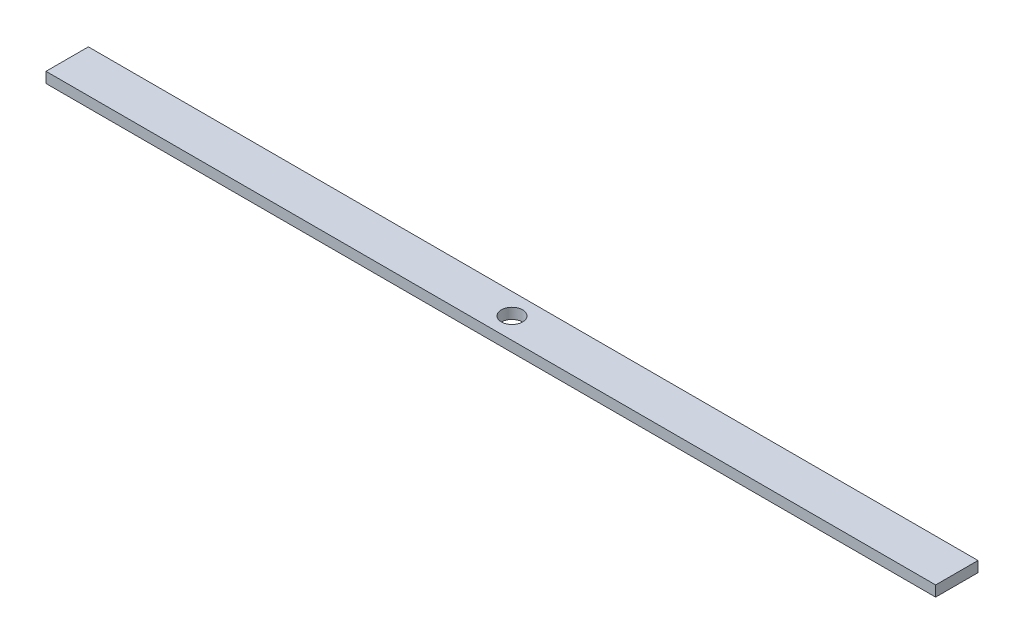
ISO-10303-21;
HEADER;
FILE_DESCRIPTION(('STEP AP214'),'2;1');
FILE_NAME('part.step','',(''),(''),'','','');
FILE_SCHEMA(('AUTOMOTIVE_DESIGN { 1 0 10303 214 1 1 1 1 }'));
ENDSEC;
DATA;
#1=APPLICATION_CONTEXT('core data for automotive mechanical design processes');
#2=APPLICATION_PROTOCOL_DEFINITION('international standard','automotive_design',2000,#1);
#3=PRODUCT_CONTEXT('',#1,'mechanical');
#4=PRODUCT('Part','Part','',(#3));
#5=PRODUCT_RELATED_PRODUCT_CATEGORY('part','',(#4));
#6=PRODUCT_DEFINITION_FORMATION('','',#4);
#7=PRODUCT_DEFINITION_CONTEXT('part definition',#1,'design');
#8=PRODUCT_DEFINITION('design','',#6,#7);
#9=PRODUCT_DEFINITION_SHAPE('','',#8);
#10=(LENGTH_UNIT() NAMED_UNIT(*) SI_UNIT(.MILLI.,.METRE.));
#11=(NAMED_UNIT(*) PLANE_ANGLE_UNIT() SI_UNIT($,.RADIAN.));
#12=(NAMED_UNIT(*) SI_UNIT($,.STERADIAN.) SOLID_ANGLE_UNIT());
#13=UNCERTAINTY_MEASURE_WITH_UNIT(LENGTH_MEASURE(1.E-05),#10,'distance_accuracy_value','');
#14=(GEOMETRIC_REPRESENTATION_CONTEXT(3) GLOBAL_UNCERTAINTY_ASSIGNED_CONTEXT((#13)) GLOBAL_UNIT_ASSIGNED_CONTEXT((#10,
#11,#12)) REPRESENTATION_CONTEXT('',''));
#15=CARTESIAN_POINT('',(0.,0.,0.));
#16=DIRECTION('',(0.,0.,1.));
#17=DIRECTION('',(1.,0.,0.));
#18=AXIS2_PLACEMENT_3D('',#15,#16,#17);
#19=CARTESIAN_POINT('',(0.,6.35,0.));
#20=DIRECTION('',(0.,1.,0.));
#21=DIRECTION('',(0.,0.,1.));
#22=AXIS2_PLACEMENT_3D('',#19,#20,#21);
#23=PLANE('',#22);
#24=DIRECTION('',(0.,0.,-1.));
#25=VECTOR('',#24,1.);
#26=CARTESIAN_POINT('',(266.7,6.35,-12.7));
#27=LINE('',#26,#25);
#28=CARTESIAN_POINT('',(266.7,6.35,12.7));
#29=VERTEX_POINT('',#28);
#30=CARTESIAN_POINT('',(266.7,6.35,-12.7));
#31=VERTEX_POINT('',#30);
#32=EDGE_CURVE('E92',#29,#31,#27,.T.);
#33=ORIENTED_EDGE('',*,*,#32,.T.);
#34=DIRECTION('',(-1.,0.,0.));
#35=VECTOR('',#34,1.);
#36=CARTESIAN_POINT('',(-266.7,6.35,-12.7));
#37=LINE('',#36,#35);
#38=CARTESIAN_POINT('',(-266.7,6.35,-12.7));
#39=VERTEX_POINT('',#38);
#40=EDGE_CURVE('E87',#31,#39,#37,.T.);
#41=ORIENTED_EDGE('',*,*,#40,.T.);
#42=DIRECTION('',(0.,0.,1.));
#43=VECTOR('',#42,1.);
#44=CARTESIAN_POINT('',(-266.7,6.35,-12.7));
#45=LINE('',#44,#43);
#46=CARTESIAN_POINT('',(-266.7,6.35,12.7));
#47=VERTEX_POINT('',#46);
#48=EDGE_CURVE('E90',#39,#47,#45,.T.);
#49=ORIENTED_EDGE('',*,*,#48,.T.);
#50=DIRECTION('',(1.,0.,0.));
#51=VECTOR('',#50,1.);
#52=CARTESIAN_POINT('',(-266.7,6.35,12.7));
#53=LINE('',#52,#51);
#54=EDGE_CURVE('E57',#47,#29,#53,.T.);
#55=ORIENTED_EDGE('',*,*,#54,.T.);
#56=EDGE_LOOP('',(#33,#41,#49,#55));
#57=FACE_BOUND('',#56,.T.);
#58=CARTESIAN_POINT('',(0.,6.35,0.));
#59=DIRECTION('',(0.,1.,0.));
#60=DIRECTION('',(0.,0.,1.));
#61=AXIS2_PLACEMENT_3D('',#58,#59,#60);
#62=CIRCLE('',#61,6.35);
#63=CARTESIAN_POINT('',(0.,6.35,6.35));
#64=VERTEX_POINT('',#63);
#65=EDGE_CURVE('E112',#64,#64,#62,.T.);
#66=ORIENTED_EDGE('',*,*,#65,.F.);
#67=EDGE_LOOP('',(#66));
#68=FACE_BOUND('',#67,.T.);
#69=ADVANCED_FACE('F39',(#57,#68),#23,.T.);
#70=CARTESIAN_POINT('',(0.,0.,0.));
#71=DIRECTION('',(0.,1.,0.));
#72=DIRECTION('',(0.,0.,1.));
#73=AXIS2_PLACEMENT_3D('',#70,#71,#72);
#74=PLANE('',#73);
#75=DIRECTION('',(0.,0.,-1.));
#76=VECTOR('',#75,1.);
#77=CARTESIAN_POINT('',(266.7,0.,-12.7));
#78=LINE('',#77,#76);
#79=CARTESIAN_POINT('',(266.7,0.,12.7));
#80=VERTEX_POINT('',#79);
#81=CARTESIAN_POINT('',(266.7,0.,-12.7));
#82=VERTEX_POINT('',#81);
#83=EDGE_CURVE('E108',#80,#82,#78,.T.);
#84=ORIENTED_EDGE('',*,*,#83,.F.);
#85=DIRECTION('',(1.,0.,0.));
#86=VECTOR('',#85,1.);
#87=CARTESIAN_POINT('',(-266.7,0.,12.7));
#88=LINE('',#87,#86);
#89=CARTESIAN_POINT('',(-266.7,0.,12.7));
#90=VERTEX_POINT('',#89);
#91=EDGE_CURVE('E80',#90,#80,#88,.T.);
#92=ORIENTED_EDGE('',*,*,#91,.F.);
#93=DIRECTION('',(0.,0.,1.));
#94=VECTOR('',#93,1.);
#95=CARTESIAN_POINT('',(-266.7,0.,-12.7));
#96=LINE('',#95,#94);
#97=CARTESIAN_POINT('',(-266.7,0.,-12.7));
#98=VERTEX_POINT('',#97);
#99=EDGE_CURVE('E74',#98,#90,#96,.T.);
#100=ORIENTED_EDGE('',*,*,#99,.F.);
#101=DIRECTION('',(-1.,0.,0.));
#102=VECTOR('',#101,1.);
#103=CARTESIAN_POINT('',(-266.7,0.,-12.7));
#104=LINE('',#103,#102);
#105=EDGE_CURVE('E97',#82,#98,#104,.T.);
#106=ORIENTED_EDGE('',*,*,#105,.F.);
#107=EDGE_LOOP('',(#84,#92,#100,#106));
#108=FACE_BOUND('',#107,.T.);
#109=CARTESIAN_POINT('',(0.,0.,0.));
#110=DIRECTION('',(0.,1.,0.));
#111=DIRECTION('',(0.,0.,1.));
#112=AXIS2_PLACEMENT_3D('',#109,#110,#111);
#113=CIRCLE('',#112,6.35);
#114=CARTESIAN_POINT('',(0.,0.,6.35));
#115=VERTEX_POINT('',#114);
#116=EDGE_CURVE('E130',#115,#115,#113,.T.);
#117=ORIENTED_EDGE('',*,*,#116,.T.);
#118=EDGE_LOOP('',(#117));
#119=FACE_BOUND('',#118,.T.);
#120=ADVANCED_FACE('F125',(#108,#119),#74,.F.);
#121=CARTESIAN_POINT('',(266.7,6.35,-12.7));
#122=DIRECTION('',(-1.,0.,0.));
#123=DIRECTION('',(0.,0.,1.));
#124=AXIS2_PLACEMENT_3D('',#121,#122,#123);
#125=PLANE('',#124);
#126=ORIENTED_EDGE('',*,*,#83,.T.);
#127=DIRECTION('',(0.,-1.,0.));
#128=VECTOR('',#127,1.);
#129=CARTESIAN_POINT('',(266.7,6.35,-12.7));
#130=LINE('',#129,#128);
#131=EDGE_CURVE('E11',#31,#82,#130,.T.);
#132=ORIENTED_EDGE('',*,*,#131,.F.);
#133=ORIENTED_EDGE('',*,*,#32,.F.);
#134=DIRECTION('',(0.,-1.,0.));
#135=VECTOR('',#134,1.);
#136=CARTESIAN_POINT('',(266.7,6.35,12.7));
#137=LINE('',#136,#135);
#138=EDGE_CURVE('E104',#29,#80,#137,.T.);
#139=ORIENTED_EDGE('',*,*,#138,.T.);
#140=EDGE_LOOP('',(#126,#132,#133,#139));
#141=FACE_BOUND('',#140,.T.);
#142=ADVANCED_FACE('F41',(#141),#125,.F.);
#143=CARTESIAN_POINT('',(-266.7,6.35,-12.7));
#144=DIRECTION('',(0.,0.,1.));
#145=DIRECTION('',(1.,0.,0.));
#146=AXIS2_PLACEMENT_3D('',#143,#144,#145);
#147=PLANE('',#146);
#148=ORIENTED_EDGE('',*,*,#105,.T.);
#149=DIRECTION('',(0.,-1.,0.));
#150=VECTOR('',#149,1.);
#151=CARTESIAN_POINT('',(-266.7,6.35,-12.7));
#152=LINE('',#151,#150);
#153=EDGE_CURVE('E49',#39,#98,#152,.T.);
#154=ORIENTED_EDGE('',*,*,#153,.F.);
#155=ORIENTED_EDGE('',*,*,#40,.F.);
#156=ORIENTED_EDGE('',*,*,#131,.T.);
#157=EDGE_LOOP('',(#148,#154,#155,#156));
#158=FACE_BOUND('',#157,.T.);
#159=ADVANCED_FACE('F96',(#158),#147,.F.);
#160=CARTESIAN_POINT('',(-266.7,6.35,-12.7));
#161=DIRECTION('',(1.,0.,0.));
#162=DIRECTION('',(0.,0.,-1.));
#163=AXIS2_PLACEMENT_3D('',#160,#161,#162);
#164=PLANE('',#163);
#165=ORIENTED_EDGE('',*,*,#99,.T.);
#166=DIRECTION('',(0.,-1.,0.));
#167=VECTOR('',#166,1.);
#168=CARTESIAN_POINT('',(-266.7,6.35,12.7));
#169=LINE('',#168,#167);
#170=EDGE_CURVE('E99',#47,#90,#169,.T.);
#171=ORIENTED_EDGE('',*,*,#170,.F.);
#172=ORIENTED_EDGE('',*,*,#48,.F.);
#173=ORIENTED_EDGE('',*,*,#153,.T.);
#174=EDGE_LOOP('',(#165,#171,#172,#173));
#175=FACE_BOUND('',#174,.T.);
#176=ADVANCED_FACE('F100',(#175),#164,.F.);
#177=CARTESIAN_POINT('',(-266.7,6.35,12.7));
#178=DIRECTION('',(0.,0.,-1.));
#179=DIRECTION('',(-1.,0.,0.));
#180=AXIS2_PLACEMENT_3D('',#177,#178,#179);
#181=PLANE('',#180);
#182=ORIENTED_EDGE('',*,*,#91,.T.);
#183=ORIENTED_EDGE('',*,*,#138,.F.);
#184=ORIENTED_EDGE('',*,*,#54,.F.);
#185=ORIENTED_EDGE('',*,*,#170,.T.);
#186=EDGE_LOOP('',(#182,#183,#184,#185));
#187=FACE_BOUND('',#186,.T.);
#188=ADVANCED_FACE('F122',(#187),#181,.F.);
#189=CARTESIAN_POINT('',(0.,6.35,0.));
#190=DIRECTION('',(0.,-1.,0.));
#191=DIRECTION('',(0.,0.,-1.));
#192=AXIS2_PLACEMENT_3D('',#189,#190,#191);
#193=CYLINDRICAL_SURFACE('',#192,6.35);
#194=ORIENTED_EDGE('',*,*,#65,.T.);
#195=EDGE_LOOP('',(#194));
#196=FACE_BOUND('',#195,.T.);
#197=ORIENTED_EDGE('',*,*,#116,.F.);
#198=EDGE_LOOP('',(#197));
#199=FACE_BOUND('',#198,.T.);
#200=ADVANCED_FACE('F138',(#196,#199),#193,.F.);
#201=CLOSED_SHELL('',(#69,#120,#142,#159,#176,#188,#200));
#202=MANIFOLD_SOLID_BREP('B2',#201);
#203=ADVANCED_BREP_SHAPE_REPRESENTATION('',(#18,#202),#14);
#204=SHAPE_DEFINITION_REPRESENTATION(#9,#203);
ENDSEC;
END-ISO-10303-21;
